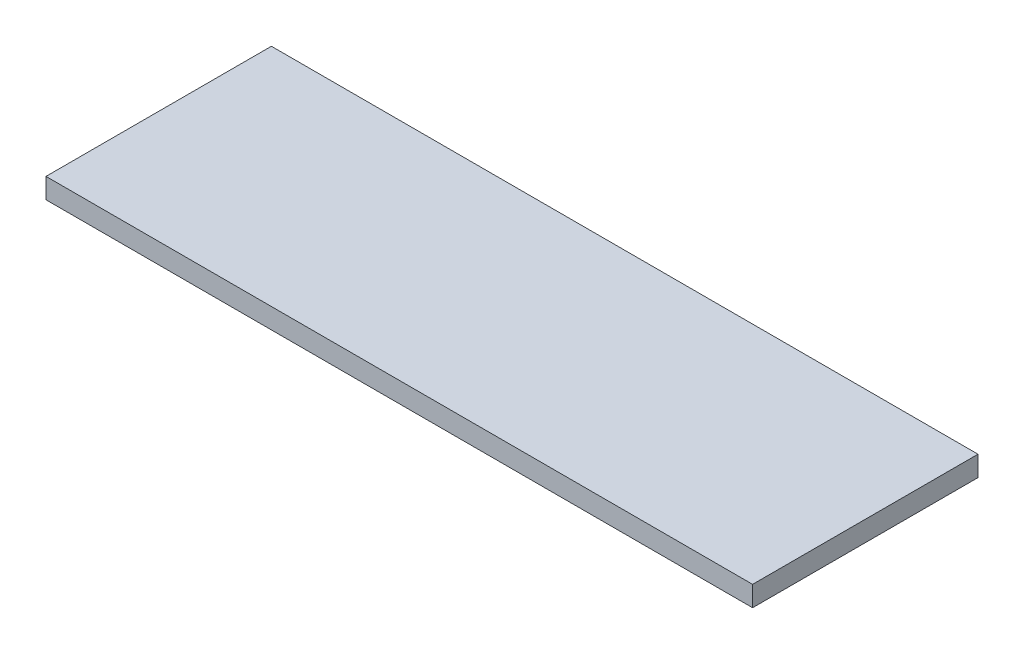
ISO-10303-21;
HEADER;
FILE_DESCRIPTION(('STEP AP214'),'2;1');
FILE_NAME('part.step','',(''),(''),'','','');
FILE_SCHEMA(('AUTOMOTIVE_DESIGN { 1 0 10303 214 1 1 1 1 }'));
ENDSEC;
DATA;
#1=APPLICATION_CONTEXT('core data for automotive mechanical design processes');
#2=APPLICATION_PROTOCOL_DEFINITION('international standard','automotive_design',2000,#1);
#3=PRODUCT_CONTEXT('',#1,'mechanical');
#4=PRODUCT('Part','Part','',(#3));
#5=PRODUCT_RELATED_PRODUCT_CATEGORY('part','',(#4));
#6=PRODUCT_DEFINITION_FORMATION('','',#4);
#7=PRODUCT_DEFINITION_CONTEXT('part definition',#1,'design');
#8=PRODUCT_DEFINITION('design','',#6,#7);
#9=PRODUCT_DEFINITION_SHAPE('','',#8);
#10=(LENGTH_UNIT() NAMED_UNIT(*) SI_UNIT(.MILLI.,.METRE.));
#11=(NAMED_UNIT(*) PLANE_ANGLE_UNIT() SI_UNIT($,.RADIAN.));
#12=(NAMED_UNIT(*) SI_UNIT($,.STERADIAN.) SOLID_ANGLE_UNIT());
#13=UNCERTAINTY_MEASURE_WITH_UNIT(LENGTH_MEASURE(1.E-05),#10,'distance_accuracy_value','');
#14=(GEOMETRIC_REPRESENTATION_CONTEXT(3) GLOBAL_UNCERTAINTY_ASSIGNED_CONTEXT((#13)) GLOBAL_UNIT_ASSIGNED_CONTEXT((#10,
#11,#12)) REPRESENTATION_CONTEXT('',''));
#15=CARTESIAN_POINT('',(0.,0.,0.));
#16=DIRECTION('',(0.,0.,1.));
#17=DIRECTION('',(1.,0.,0.));
#18=AXIS2_PLACEMENT_3D('',#15,#16,#17);
#19=CARTESIAN_POINT('',(-313.5,18.,100.));
#20=DIRECTION('',(1.,0.,0.));
#21=DIRECTION('',(0.,0.,-1.));
#22=AXIS2_PLACEMENT_3D('',#19,#20,#21);
#23=PLANE('',#22);
#24=DIRECTION('',(0.,0.,1.));
#25=VECTOR('',#24,1.);
#26=CARTESIAN_POINT('',(-313.5,0.,100.));
#27=LINE('',#26,#25);
#28=CARTESIAN_POINT('',(-313.5,0.,-100.));
#29=VERTEX_POINT('',#28);
#30=CARTESIAN_POINT('',(-313.5,0.,100.));
#31=VERTEX_POINT('',#30);
#32=EDGE_CURVE('E98',#29,#31,#27,.T.);
#33=ORIENTED_EDGE('',*,*,#32,.T.);
#34=DIRECTION('',(0.,-1.,0.));
#35=VECTOR('',#34,1.);
#36=CARTESIAN_POINT('',(-313.5,18.,100.));
#37=LINE('',#36,#35);
#38=CARTESIAN_POINT('',(-313.5,18.,100.));
#39=VERTEX_POINT('',#38);
#40=EDGE_CURVE('E11',#39,#31,#37,.T.);
#41=ORIENTED_EDGE('',*,*,#40,.F.);
#42=DIRECTION('',(0.,0.,1.));
#43=VECTOR('',#42,1.);
#44=CARTESIAN_POINT('',(-313.5,18.,100.));
#45=LINE('',#44,#43);
#46=CARTESIAN_POINT('',(-313.5,18.,-100.));
#47=VERTEX_POINT('',#46);
#48=EDGE_CURVE('E86',#47,#39,#45,.T.);
#49=ORIENTED_EDGE('',*,*,#48,.F.);
#50=DIRECTION('',(0.,-1.,0.));
#51=VECTOR('',#50,1.);
#52=CARTESIAN_POINT('',(-313.5,18.,-100.));
#53=LINE('',#52,#51);
#54=EDGE_CURVE('E94',#47,#29,#53,.T.);
#55=ORIENTED_EDGE('',*,*,#54,.T.);
#56=EDGE_LOOP('',(#33,#41,#49,#55));
#57=FACE_BOUND('',#56,.T.);
#58=ADVANCED_FACE('F35',(#57),#23,.F.);
#59=CARTESIAN_POINT('',(313.5,18.,99.9999999999999));
#60=DIRECTION('',(0.,0.,-1.));
#61=DIRECTION('',(-1.,0.,0.));
#62=AXIS2_PLACEMENT_3D('',#59,#60,#61);
#63=PLANE('',#62);
#64=DIRECTION('',(1.,0.,0.));
#65=VECTOR('',#64,1.);
#66=CARTESIAN_POINT('',(313.5,0.,99.9999999999999));
#67=LINE('',#66,#65);
#68=CARTESIAN_POINT('',(313.5,0.,99.9999999999999));
#69=VERTEX_POINT('',#68);
#70=EDGE_CURVE('E90',#31,#69,#67,.T.);
#71=ORIENTED_EDGE('',*,*,#70,.T.);
#72=DIRECTION('',(0.,-1.,0.));
#73=VECTOR('',#72,1.);
#74=CARTESIAN_POINT('',(313.5,18.,99.9999999999999));
#75=LINE('',#74,#73);
#76=CARTESIAN_POINT('',(313.5,18.,99.9999999999999));
#77=VERTEX_POINT('',#76);
#78=EDGE_CURVE('E43',#77,#69,#75,.T.);
#79=ORIENTED_EDGE('',*,*,#78,.F.);
#80=DIRECTION('',(1.,0.,0.));
#81=VECTOR('',#80,1.);
#82=CARTESIAN_POINT('',(313.5,18.,99.9999999999999));
#83=LINE('',#82,#81);
#84=EDGE_CURVE('E81',#39,#77,#83,.T.);
#85=ORIENTED_EDGE('',*,*,#84,.F.);
#86=ORIENTED_EDGE('',*,*,#40,.T.);
#87=EDGE_LOOP('',(#71,#79,#85,#86));
#88=FACE_BOUND('',#87,.T.);
#89=ADVANCED_FACE('F89',(#88),#63,.F.);
#90=CARTESIAN_POINT('',(313.5,18.,99.9999999999999));
#91=DIRECTION('',(-1.,0.,0.));
#92=DIRECTION('',(0.,0.,1.));
#93=AXIS2_PLACEMENT_3D('',#90,#91,#92);
#94=PLANE('',#93);
#95=DIRECTION('',(0.,0.,-1.));
#96=VECTOR('',#95,1.);
#97=CARTESIAN_POINT('',(313.5,0.,99.9999999999999));
#98=LINE('',#97,#96);
#99=CARTESIAN_POINT('',(313.5,0.,-100.));
#100=VERTEX_POINT('',#99);
#101=EDGE_CURVE('E68',#69,#100,#98,.T.);
#102=ORIENTED_EDGE('',*,*,#101,.T.);
#103=DIRECTION('',(0.,-1.,0.));
#104=VECTOR('',#103,1.);
#105=CARTESIAN_POINT('',(313.5,18.,-100.));
#106=LINE('',#105,#104);
#107=CARTESIAN_POINT('',(313.5,18.,-100.));
#108=VERTEX_POINT('',#107);
#109=EDGE_CURVE('E91',#108,#100,#106,.T.);
#110=ORIENTED_EDGE('',*,*,#109,.F.);
#111=DIRECTION('',(0.,0.,-1.));
#112=VECTOR('',#111,1.);
#113=CARTESIAN_POINT('',(313.5,18.,99.9999999999999));
#114=LINE('',#113,#112);
#115=EDGE_CURVE('E84',#77,#108,#114,.T.);
#116=ORIENTED_EDGE('',*,*,#115,.F.);
#117=ORIENTED_EDGE('',*,*,#78,.T.);
#118=EDGE_LOOP('',(#102,#110,#116,#117));
#119=FACE_BOUND('',#118,.T.);
#120=ADVANCED_FACE('F92',(#119),#94,.F.);
#121=CARTESIAN_POINT('',(313.5,18.,-100.));
#122=DIRECTION('',(0.,0.,1.));
#123=DIRECTION('',(1.,0.,0.));
#124=AXIS2_PLACEMENT_3D('',#121,#122,#123);
#125=PLANE('',#124);
#126=DIRECTION('',(-1.,0.,0.));
#127=VECTOR('',#126,1.);
#128=CARTESIAN_POINT('',(313.5,0.,-100.));
#129=LINE('',#128,#127);
#130=EDGE_CURVE('E74',#100,#29,#129,.T.);
#131=ORIENTED_EDGE('',*,*,#130,.T.);
#132=ORIENTED_EDGE('',*,*,#54,.F.);
#133=DIRECTION('',(-1.,0.,0.));
#134=VECTOR('',#133,1.);
#135=CARTESIAN_POINT('',(313.5,18.,-100.));
#136=LINE('',#135,#134);
#137=EDGE_CURVE('E51',#108,#47,#136,.T.);
#138=ORIENTED_EDGE('',*,*,#137,.F.);
#139=ORIENTED_EDGE('',*,*,#109,.T.);
#140=EDGE_LOOP('',(#131,#132,#138,#139));
#141=FACE_BOUND('',#140,.T.);
#142=ADVANCED_FACE('F105',(#141),#125,.F.);
#143=CARTESIAN_POINT('',(0.,18.,0.));
#144=DIRECTION('',(0.,1.,0.));
#145=DIRECTION('',(0.,0.,1.));
#146=AXIS2_PLACEMENT_3D('',#143,#144,#145);
#147=PLANE('',#146);
#148=ORIENTED_EDGE('',*,*,#48,.T.);
#149=ORIENTED_EDGE('',*,*,#84,.T.);
#150=ORIENTED_EDGE('',*,*,#115,.T.);
#151=ORIENTED_EDGE('',*,*,#137,.T.);
#152=EDGE_LOOP('',(#148,#149,#150,#151));
#153=FACE_BOUND('',#152,.T.);
#154=ADVANCED_FACE('F82',(#153),#147,.T.);
#155=CARTESIAN_POINT('',(0.,0.,0.));
#156=DIRECTION('',(0.,1.,0.));
#157=DIRECTION('',(0.,0.,1.));
#158=AXIS2_PLACEMENT_3D('',#155,#156,#157);
#159=PLANE('',#158);
#160=ORIENTED_EDGE('',*,*,#32,.F.);
#161=ORIENTED_EDGE('',*,*,#130,.F.);
#162=ORIENTED_EDGE('',*,*,#101,.F.);
#163=ORIENTED_EDGE('',*,*,#70,.F.);
#164=EDGE_LOOP('',(#160,#161,#162,#163));
#165=FACE_BOUND('',#164,.T.);
#166=ADVANCED_FACE('F108',(#165),#159,.F.);
#167=CLOSED_SHELL('',(#58,#89,#120,#142,#154,#166));
#168=MANIFOLD_SOLID_BREP('B2',#167);
#169=ADVANCED_BREP_SHAPE_REPRESENTATION('',(#18,#168),#14);
#170=SHAPE_DEFINITION_REPRESENTATION(#9,#169);
ENDSEC;
END-ISO-10303-21;
